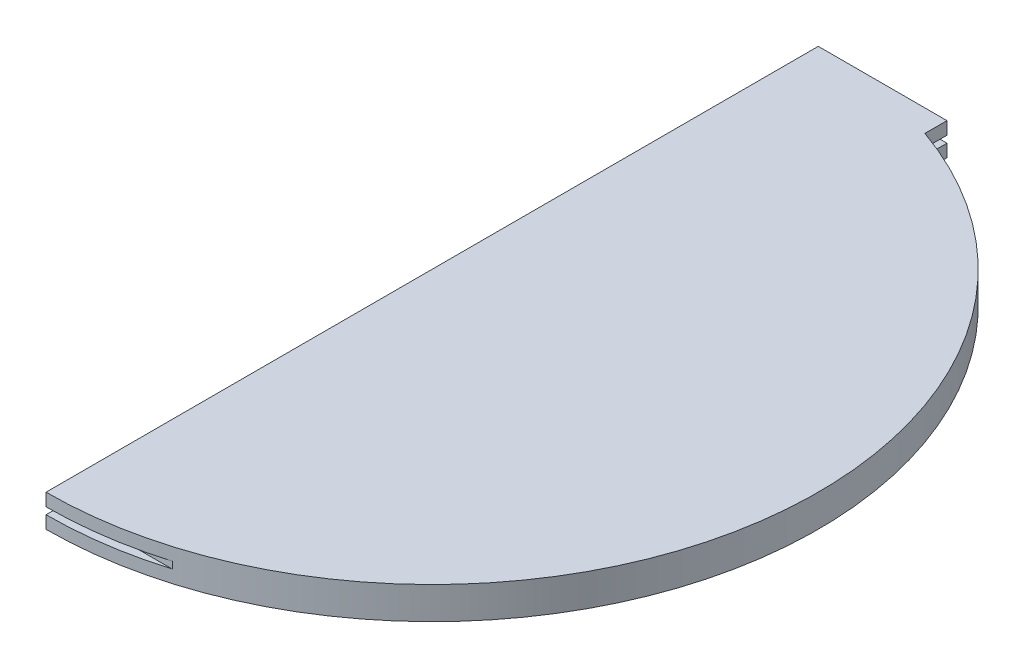
ISO-10303-21;
HEADER;
FILE_DESCRIPTION(('STEP AP214'),'2;1');
FILE_NAME('part.step','',(''),(''),'','','');
FILE_SCHEMA(('AUTOMOTIVE_DESIGN { 1 0 10303 214 1 1 1 1 }'));
ENDSEC;
DATA;
#1=APPLICATION_CONTEXT('core data for automotive mechanical design processes');
#2=APPLICATION_PROTOCOL_DEFINITION('international standard','automotive_design',2000,#1);
#3=PRODUCT_CONTEXT('',#1,'mechanical');
#4=PRODUCT('Part','Part','',(#3));
#5=PRODUCT_RELATED_PRODUCT_CATEGORY('part','',(#4));
#6=PRODUCT_DEFINITION_FORMATION('','',#4);
#7=PRODUCT_DEFINITION_CONTEXT('part definition',#1,'design');
#8=PRODUCT_DEFINITION('design','',#6,#7);
#9=PRODUCT_DEFINITION_SHAPE('','',#8);
#10=(LENGTH_UNIT() NAMED_UNIT(*) SI_UNIT(.MILLI.,.METRE.));
#11=(NAMED_UNIT(*) PLANE_ANGLE_UNIT() SI_UNIT($,.RADIAN.));
#12=(NAMED_UNIT(*) SI_UNIT($,.STERADIAN.) SOLID_ANGLE_UNIT());
#13=UNCERTAINTY_MEASURE_WITH_UNIT(LENGTH_MEASURE(1.E-05),#10,'distance_accuracy_value','');
#14=(GEOMETRIC_REPRESENTATION_CONTEXT(3) GLOBAL_UNCERTAINTY_ASSIGNED_CONTEXT((#13)) GLOBAL_UNIT_ASSIGNED_CONTEXT((#10,
#11,#12)) REPRESENTATION_CONTEXT('',''));
#15=CARTESIAN_POINT('',(0.,0.,0.));
#16=DIRECTION('',(0.,0.,1.));
#17=DIRECTION('',(1.,0.,0.));
#18=AXIS2_PLACEMENT_3D('',#15,#16,#17);
#19=CARTESIAN_POINT('',(-228.6,38.1,-457.2));
#20=DIRECTION('',(0.,0.,1.));
#21=DIRECTION('',(1.,0.,0.));
#22=AXIS2_PLACEMENT_3D('',#19,#20,#21);
#23=PLANE('',#22);
#24=DIRECTION('',(0.,-1.,0.));
#25=VECTOR('',#24,1.);
#26=CARTESIAN_POINT('',(-228.6,38.1,-457.2));
#27=LINE('',#26,#25);
#28=CARTESIAN_POINT('',(-228.6,14.986,-457.2));
#29=VERTEX_POINT('',#28);
#30=CARTESIAN_POINT('',(-228.6,0.,-457.2));
#31=VERTEX_POINT('',#30);
#32=EDGE_CURVE('E193',#29,#31,#27,.T.);
#33=ORIENTED_EDGE('',*,*,#32,.F.);
#34=DIRECTION('',(1.,0.,0.));
#35=VECTOR('',#34,1.);
#36=CARTESIAN_POINT('',(-228.6,14.986,-457.2));
#37=LINE('',#36,#35);
#38=CARTESIAN_POINT('',(-76.1999999999998,14.986,-457.2));
#39=VERTEX_POINT('',#38);
#40=EDGE_CURVE('E155',#29,#39,#37,.T.);
#41=ORIENTED_EDGE('',*,*,#40,.T.);
#42=DIRECTION('',(0.,-1.,0.));
#43=VECTOR('',#42,1.);
#44=CARTESIAN_POINT('',(-76.1999999999998,38.1,-457.2));
#45=LINE('',#44,#43);
#46=CARTESIAN_POINT('',(-76.1999999999998,0.,-457.2));
#47=VERTEX_POINT('',#46);
#48=EDGE_CURVE('E197',#39,#47,#45,.T.);
#49=ORIENTED_EDGE('',*,*,#48,.T.);
#50=DIRECTION('',(-1.,0.,0.));
#51=VECTOR('',#50,1.);
#52=CARTESIAN_POINT('',(-228.6,0.,-457.2));
#53=LINE('',#52,#51);
#54=EDGE_CURVE('E186',#47,#31,#53,.T.);
#55=ORIENTED_EDGE('',*,*,#54,.T.);
#56=EDGE_LOOP('',(#33,#41,#49,#55));
#57=FACE_BOUND('',#56,.T.);
#58=ADVANCED_FACE('F37',(#57),#23,.F.);
#59=CARTESIAN_POINT('',(-228.6,38.1,-2.22044604925031E-13));
#60=DIRECTION('',(0.,-1.,0.));
#61=DIRECTION('',(0.,0.,-1.));
#62=AXIS2_PLACEMENT_3D('',#59,#60,#61);
#63=CYLINDRICAL_SURFACE('',#62,457.2);
#64=DIRECTION('',(0.,-1.,0.));
#65=VECTOR('',#64,1.);
#66=CARTESIAN_POINT('',(-97.9997798623589,38.1,438.15));
#67=LINE('',#66,#65);
#68=CARTESIAN_POINT('',(-97.9997798623589,23.114,438.149999999999));
#69=VERTEX_POINT('',#68);
#70=CARTESIAN_POINT('',(-97.9997798623587,14.986,438.15));
#71=VERTEX_POINT('',#70);
#72=EDGE_CURVE('E128',#69,#71,#67,.T.);
#73=ORIENTED_EDGE('',*,*,#72,.T.);
#74=CARTESIAN_POINT('',(-228.6,14.986,-2.22044604925031E-13));
#75=DIRECTION('',(0.,-1.,0.));
#76=DIRECTION('',(0.,0.,-1.));
#77=AXIS2_PLACEMENT_3D('',#74,#75,#76);
#78=CIRCLE('',#77,457.2);
#79=CARTESIAN_POINT('',(-228.6,14.986,457.2));
#80=VERTEX_POINT('',#79);
#81=EDGE_CURVE('E166',#71,#80,#78,.T.);
#82=ORIENTED_EDGE('',*,*,#81,.T.);
#83=DIRECTION('',(0.,-1.,0.));
#84=VECTOR('',#83,1.);
#85=CARTESIAN_POINT('',(-228.6,38.1,457.2));
#86=LINE('',#85,#84);
#87=CARTESIAN_POINT('',(-228.6,0.,457.2));
#88=VERTEX_POINT('',#87);
#89=EDGE_CURVE('E180',#80,#88,#86,.T.);
#90=ORIENTED_EDGE('',*,*,#89,.T.);
#91=CARTESIAN_POINT('',(-228.6,0.,-2.22044604925031E-13));
#92=DIRECTION('',(0.,1.,0.));
#93=DIRECTION('',(0.,0.,-1.));
#94=AXIS2_PLACEMENT_3D('',#91,#92,#93);
#95=CIRCLE('',#94,457.2);
#96=CARTESIAN_POINT('',(-76.1999999999998,0.,-431.05229381132));
#97=VERTEX_POINT('',#96);
#98=EDGE_CURVE('E169',#88,#97,#95,.T.);
#99=ORIENTED_EDGE('',*,*,#98,.T.);
#100=DIRECTION('',(0.,-1.,0.));
#101=VECTOR('',#100,1.);
#102=CARTESIAN_POINT('',(-76.1999999999998,38.1,-431.05229381132));
#103=LINE('',#102,#101);
#104=CARTESIAN_POINT('',(-76.1999999999998,38.1,-431.05229381132));
#105=VERTEX_POINT('',#104);
#106=EDGE_CURVE('E201',#105,#97,#103,.T.);
#107=ORIENTED_EDGE('',*,*,#106,.F.);
#108=CARTESIAN_POINT('',(-228.6,38.1,-2.22044604925031E-13));
#109=DIRECTION('',(0.,1.,0.));
#110=DIRECTION('',(0.,0.,-1.));
#111=AXIS2_PLACEMENT_3D('',#108,#109,#110);
#112=CIRCLE('',#111,457.2);
#113=CARTESIAN_POINT('',(-228.6,38.1,457.2));
#114=VERTEX_POINT('',#113);
#115=EDGE_CURVE('E170',#114,#105,#112,.T.);
#116=ORIENTED_EDGE('',*,*,#115,.F.);
#117=CARTESIAN_POINT('',(-228.6,23.114,457.2));
#118=VERTEX_POINT('',#117);
#119=EDGE_CURVE('E191',#114,#118,#86,.T.);
#120=ORIENTED_EDGE('',*,*,#119,.T.);
#121=CARTESIAN_POINT('',(-228.6,23.114,-2.22044604925031E-13));
#122=DIRECTION('',(0.,1.,0.));
#123=DIRECTION('',(0.,0.,1.));
#124=AXIS2_PLACEMENT_3D('',#121,#122,#123);
#125=CIRCLE('',#124,457.2);
#126=EDGE_CURVE('E60',#118,#69,#125,.T.);
#127=ORIENTED_EDGE('',*,*,#126,.T.);
#128=EDGE_LOOP('',(#73,#82,#90,#99,#107,#116,#120,#127));
#129=FACE_BOUND('',#128,.T.);
#130=ADVANCED_FACE('F39',(#129),#63,.T.);
#131=CARTESIAN_POINT('',(-76.1999999999998,38.1,-457.2));
#132=DIRECTION('',(-1.,0.,0.));
#133=DIRECTION('',(0.,0.,1.));
#134=AXIS2_PLACEMENT_3D('',#131,#132,#133);
#135=PLANE('',#134);
#136=ORIENTED_EDGE('',*,*,#48,.F.);
#137=DIRECTION('',(0.,0.,1.));
#138=VECTOR('',#137,1.);
#139=CARTESIAN_POINT('',(-76.1999999999998,14.986,-457.2));
#140=LINE('',#139,#138);
#141=CARTESIAN_POINT('',(-76.1999999999997,14.986,-438.15));
#142=VERTEX_POINT('',#141);
#143=EDGE_CURVE('E158',#39,#142,#140,.T.);
#144=ORIENTED_EDGE('',*,*,#143,.T.);
#145=DIRECTION('',(0.,1.,0.));
#146=VECTOR('',#145,1.);
#147=CARTESIAN_POINT('',(-76.1999999999998,38.1,-438.15));
#148=LINE('',#147,#146);
#149=CARTESIAN_POINT('',(-76.1999999999997,23.114,-438.15));
#150=VERTEX_POINT('',#149);
#151=EDGE_CURVE('E161',#142,#150,#148,.T.);
#152=ORIENTED_EDGE('',*,*,#151,.T.);
#153=DIRECTION('',(0.,0.,-1.));
#154=VECTOR('',#153,1.);
#155=CARTESIAN_POINT('',(-76.1999999999998,23.114,-457.2));
#156=LINE('',#155,#154);
#157=CARTESIAN_POINT('',(-76.1999999999998,23.114,-457.2));
#158=VERTEX_POINT('',#157);
#159=EDGE_CURVE('E152',#150,#158,#156,.T.);
#160=ORIENTED_EDGE('',*,*,#159,.T.);
#161=CARTESIAN_POINT('',(-76.1999999999998,38.1,-457.2));
#162=VERTEX_POINT('',#161);
#163=EDGE_CURVE('E198',#162,#158,#45,.T.);
#164=ORIENTED_EDGE('',*,*,#163,.F.);
#165=DIRECTION('',(0.,0.,-1.));
#166=VECTOR('',#165,1.);
#167=CARTESIAN_POINT('',(-76.1999999999998,38.1,-457.2));
#168=LINE('',#167,#166);
#169=EDGE_CURVE('E173',#105,#162,#168,.T.);
#170=ORIENTED_EDGE('',*,*,#169,.F.);
#171=ORIENTED_EDGE('',*,*,#106,.T.);
#172=DIRECTION('',(0.,0.,-1.));
#173=VECTOR('',#172,1.);
#174=CARTESIAN_POINT('',(-76.1999999999998,0.,-457.2));
#175=LINE('',#174,#173);
#176=EDGE_CURVE('E183',#97,#47,#175,.T.);
#177=ORIENTED_EDGE('',*,*,#176,.T.);
#178=EDGE_LOOP('',(#136,#144,#152,#160,#164,#170,#171,#177));
#179=FACE_BOUND('',#178,.T.);
#180=ADVANCED_FACE('F237',(#179),#135,.F.);
#181=ORIENTED_EDGE('',*,*,#163,.T.);
#182=DIRECTION('',(-1.,0.,0.));
#183=VECTOR('',#182,1.);
#184=CARTESIAN_POINT('',(-228.6,23.114,-457.2));
#185=LINE('',#184,#183);
#186=CARTESIAN_POINT('',(-228.6,23.114,-457.2));
#187=VERTEX_POINT('',#186);
#188=EDGE_CURVE('E144',#158,#187,#185,.T.);
#189=ORIENTED_EDGE('',*,*,#188,.T.);
#190=CARTESIAN_POINT('',(-228.6,38.1,-457.2));
#191=VERTEX_POINT('',#190);
#192=EDGE_CURVE('E194',#191,#187,#27,.T.);
#193=ORIENTED_EDGE('',*,*,#192,.F.);
#194=DIRECTION('',(-1.,0.,0.));
#195=VECTOR('',#194,1.);
#196=CARTESIAN_POINT('',(-228.6,38.1,-457.2));
#197=LINE('',#196,#195);
#198=EDGE_CURVE('E176',#162,#191,#197,.T.);
#199=ORIENTED_EDGE('',*,*,#198,.F.);
#200=EDGE_LOOP('',(#181,#189,#193,#199));
#201=FACE_BOUND('',#200,.T.);
#202=ADVANCED_FACE('F233',(#201),#23,.F.);
#203=CARTESIAN_POINT('',(-228.6,38.1,457.2));
#204=DIRECTION('',(1.,0.,0.));
#205=DIRECTION('',(0.,0.,-1.));
#206=AXIS2_PLACEMENT_3D('',#203,#204,#205);
#207=PLANE('',#206);
#208=ORIENTED_EDGE('',*,*,#89,.F.);
#209=DIRECTION('',(0.,0.,1.));
#210=VECTOR('',#209,1.);
#211=CARTESIAN_POINT('',(-228.6,14.986,438.15));
#212=LINE('',#211,#210);
#213=CARTESIAN_POINT('',(-228.6,14.986,438.15));
#214=VERTEX_POINT('',#213);
#215=EDGE_CURVE('E130',#214,#80,#212,.T.);
#216=ORIENTED_EDGE('',*,*,#215,.F.);
#217=DIRECTION('',(0.,-1.,0.));
#218=VECTOR('',#217,1.);
#219=CARTESIAN_POINT('',(-228.6,23.114,438.15));
#220=LINE('',#219,#218);
#221=CARTESIAN_POINT('',(-228.6,23.114,438.15));
#222=VERTEX_POINT('',#221);
#223=EDGE_CURVE('E125',#222,#214,#220,.T.);
#224=ORIENTED_EDGE('',*,*,#223,.F.);
#225=DIRECTION('',(0.,0.,1.));
#226=VECTOR('',#225,1.);
#227=CARTESIAN_POINT('',(-228.6,23.114,457.2));
#228=LINE('',#227,#226);
#229=EDGE_CURVE('E11',#222,#118,#228,.T.);
#230=ORIENTED_EDGE('',*,*,#229,.T.);
#231=ORIENTED_EDGE('',*,*,#119,.F.);
#232=DIRECTION('',(0.,0.,1.));
#233=VECTOR('',#232,1.);
#234=CARTESIAN_POINT('',(-228.6,38.1,457.2));
#235=LINE('',#234,#233);
#236=EDGE_CURVE('E178',#191,#114,#235,.T.);
#237=ORIENTED_EDGE('',*,*,#236,.F.);
#238=ORIENTED_EDGE('',*,*,#192,.T.);
#239=DIRECTION('',(0.,0.,-1.));
#240=VECTOR('',#239,1.);
#241=CARTESIAN_POINT('',(-228.6,23.114,-438.15));
#242=LINE('',#241,#240);
#243=CARTESIAN_POINT('',(-228.6,23.114,-438.15));
#244=VERTEX_POINT('',#243);
#245=EDGE_CURVE('E147',#244,#187,#242,.T.);
#246=ORIENTED_EDGE('',*,*,#245,.F.);
#247=DIRECTION('',(0.,1.,0.));
#248=VECTOR('',#247,1.);
#249=CARTESIAN_POINT('',(-228.6,23.114,-438.15));
#250=LINE('',#249,#248);
#251=CARTESIAN_POINT('',(-228.6,14.986,-438.15));
#252=VERTEX_POINT('',#251);
#253=EDGE_CURVE('E52',#252,#244,#250,.T.);
#254=ORIENTED_EDGE('',*,*,#253,.F.);
#255=DIRECTION('',(0.,0.,-1.));
#256=VECTOR('',#255,1.);
#257=CARTESIAN_POINT('',(-228.6,14.986,457.2));
#258=LINE('',#257,#256);
#259=EDGE_CURVE('E45',#252,#29,#258,.T.);
#260=ORIENTED_EDGE('',*,*,#259,.T.);
#261=ORIENTED_EDGE('',*,*,#32,.T.);
#262=DIRECTION('',(0.,0.,1.));
#263=VECTOR('',#262,1.);
#264=CARTESIAN_POINT('',(-228.6,0.,457.2));
#265=LINE('',#264,#263);
#266=EDGE_CURVE('E174',#31,#88,#265,.T.);
#267=ORIENTED_EDGE('',*,*,#266,.T.);
#268=EDGE_LOOP('',(#208,#216,#224,#230,#231,#237,#238,#246,#254,#260,#261,#267));
#269=FACE_BOUND('',#268,.T.);
#270=ADVANCED_FACE('F137',(#269),#207,.F.);
#271=CARTESIAN_POINT('',(-228.6,38.1,-2.22044604925031E-13));
#272=DIRECTION('',(0.,-1.,0.));
#273=DIRECTION('',(0.,0.,-1.));
#274=AXIS2_PLACEMENT_3D('',#271,#272,#273);
#275=PLANE('',#274);
#276=ORIENTED_EDGE('',*,*,#115,.T.);
#277=ORIENTED_EDGE('',*,*,#169,.T.);
#278=ORIENTED_EDGE('',*,*,#198,.T.);
#279=ORIENTED_EDGE('',*,*,#236,.T.);
#280=EDGE_LOOP('',(#276,#277,#278,#279));
#281=FACE_BOUND('',#280,.T.);
#282=ADVANCED_FACE('F245',(#281),#275,.F.);
#283=CARTESIAN_POINT('',(-228.6,0.,-2.22044604925031E-13));
#284=DIRECTION('',(0.,-1.,0.));
#285=DIRECTION('',(0.,0.,-1.));
#286=AXIS2_PLACEMENT_3D('',#283,#284,#285);
#287=PLANE('',#286);
#288=ORIENTED_EDGE('',*,*,#98,.F.);
#289=ORIENTED_EDGE('',*,*,#266,.F.);
#290=ORIENTED_EDGE('',*,*,#54,.F.);
#291=ORIENTED_EDGE('',*,*,#176,.F.);
#292=EDGE_LOOP('',(#288,#289,#290,#291));
#293=FACE_BOUND('',#292,.T.);
#294=ADVANCED_FACE('F215',(#293),#287,.T.);
#295=CARTESIAN_POINT('',(228.6,23.114,-438.15));
#296=DIRECTION('',(0.,0.,1.));
#297=DIRECTION('',(1.,0.,0.));
#298=AXIS2_PLACEMENT_3D('',#295,#296,#297);
#299=PLANE('',#298);
#300=DIRECTION('',(-1.,0.,0.));
#301=VECTOR('',#300,1.);
#302=CARTESIAN_POINT('',(228.6,14.986,-438.15));
#303=LINE('',#302,#301);
#304=EDGE_CURVE('E138',#142,#252,#303,.T.);
#305=ORIENTED_EDGE('',*,*,#304,.T.);
#306=ORIENTED_EDGE('',*,*,#253,.T.);
#307=DIRECTION('',(-1.,0.,0.));
#308=VECTOR('',#307,1.);
#309=CARTESIAN_POINT('',(228.6,23.114,-438.15));
#310=LINE('',#309,#308);
#311=EDGE_CURVE('E141',#150,#244,#310,.T.);
#312=ORIENTED_EDGE('',*,*,#311,.F.);
#313=ORIENTED_EDGE('',*,*,#151,.F.);
#314=EDGE_LOOP('',(#305,#306,#312,#313));
#315=FACE_BOUND('',#314,.T.);
#316=ADVANCED_FACE('F250',(#315),#299,.F.);
#317=CARTESIAN_POINT('',(228.6,14.986,-438.15));
#318=DIRECTION('',(0.,-1.,0.));
#319=DIRECTION('',(0.,0.,-1.));
#320=AXIS2_PLACEMENT_3D('',#317,#318,#319);
#321=PLANE('',#320);
#322=ORIENTED_EDGE('',*,*,#40,.F.);
#323=ORIENTED_EDGE('',*,*,#259,.F.);
#324=ORIENTED_EDGE('',*,*,#304,.F.);
#325=ORIENTED_EDGE('',*,*,#143,.F.);
#326=EDGE_LOOP('',(#322,#323,#324,#325));
#327=FACE_BOUND('',#326,.T.);
#328=ADVANCED_FACE('F228',(#327),#321,.F.);
#329=CARTESIAN_POINT('',(228.6,23.114,-438.15));
#330=DIRECTION('',(0.,1.,0.));
#331=DIRECTION('',(0.,0.,1.));
#332=AXIS2_PLACEMENT_3D('',#329,#330,#331);
#333=PLANE('',#332);
#334=ORIENTED_EDGE('',*,*,#311,.T.);
#335=ORIENTED_EDGE('',*,*,#245,.T.);
#336=ORIENTED_EDGE('',*,*,#188,.F.);
#337=ORIENTED_EDGE('',*,*,#159,.F.);
#338=EDGE_LOOP('',(#334,#335,#336,#337));
#339=FACE_BOUND('',#338,.T.);
#340=ADVANCED_FACE('F221',(#339),#333,.F.);
#341=CARTESIAN_POINT('',(228.6,14.986,438.15));
#342=DIRECTION('',(0.,-1.,0.));
#343=DIRECTION('',(0.,0.,-1.));
#344=AXIS2_PLACEMENT_3D('',#341,#342,#343);
#345=PLANE('',#344);
#346=DIRECTION('',(-1.,0.,0.));
#347=VECTOR('',#346,1.);
#348=CARTESIAN_POINT('',(228.6,14.986,438.15));
#349=LINE('',#348,#347);
#350=EDGE_CURVE('E129',#71,#214,#349,.T.);
#351=ORIENTED_EDGE('',*,*,#350,.T.);
#352=ORIENTED_EDGE('',*,*,#215,.T.);
#353=ORIENTED_EDGE('',*,*,#81,.F.);
#354=EDGE_LOOP('',(#351,#352,#353));
#355=FACE_BOUND('',#354,.T.);
#356=ADVANCED_FACE('F219',(#355),#345,.F.);
#357=CARTESIAN_POINT('',(228.6,23.114,438.15));
#358=DIRECTION('',(0.,0.,-1.));
#359=DIRECTION('',(-1.,0.,0.));
#360=AXIS2_PLACEMENT_3D('',#357,#358,#359);
#361=PLANE('',#360);
#362=DIRECTION('',(-1.,0.,0.));
#363=VECTOR('',#362,1.);
#364=CARTESIAN_POINT('',(228.6,23.114,438.15));
#365=LINE('',#364,#363);
#366=EDGE_CURVE('E121',#69,#222,#365,.T.);
#367=ORIENTED_EDGE('',*,*,#366,.T.);
#368=ORIENTED_EDGE('',*,*,#223,.T.);
#369=ORIENTED_EDGE('',*,*,#350,.F.);
#370=ORIENTED_EDGE('',*,*,#72,.F.);
#371=EDGE_LOOP('',(#367,#368,#369,#370));
#372=FACE_BOUND('',#371,.T.);
#373=ADVANCED_FACE('F122',(#372),#361,.F.);
#374=CARTESIAN_POINT('',(228.6,23.114,438.15));
#375=DIRECTION('',(0.,1.,0.));
#376=DIRECTION('',(0.,0.,1.));
#377=AXIS2_PLACEMENT_3D('',#374,#375,#376);
#378=PLANE('',#377);
#379=ORIENTED_EDGE('',*,*,#229,.F.);
#380=ORIENTED_EDGE('',*,*,#366,.F.);
#381=ORIENTED_EDGE('',*,*,#126,.F.);
#382=EDGE_LOOP('',(#379,#380,#381));
#383=FACE_BOUND('',#382,.T.);
#384=ADVANCED_FACE('F132',(#383),#378,.F.);
#385=CLOSED_SHELL('',(#58,#130,#180,#202,#270,#282,#294,#316,#328,#340,#356,#373,#384));
#386=MANIFOLD_SOLID_BREP('B2',#385);
#387=ADVANCED_BREP_SHAPE_REPRESENTATION('',(#18,#386),#14);
#388=SHAPE_DEFINITION_REPRESENTATION(#9,#387);
ENDSEC;
END-ISO-10303-21;
